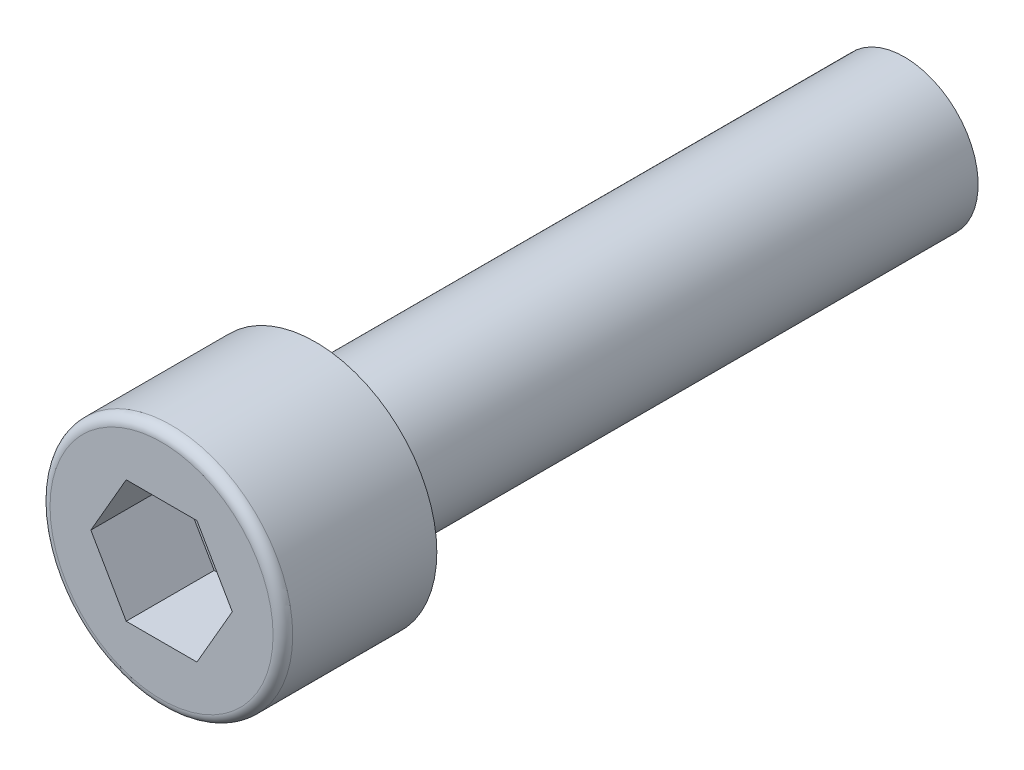
ISO-10303-21;
HEADER;
FILE_DESCRIPTION(('STEP AP214'),'2;1');
FILE_NAME('part.step','',(''),(''),'','','');
FILE_SCHEMA(('AUTOMOTIVE_DESIGN { 1 0 10303 214 1 1 1 1 }'));
ENDSEC;
DATA;
#1=APPLICATION_CONTEXT('core data for automotive mechanical design processes');
#2=APPLICATION_PROTOCOL_DEFINITION('international standard','automotive_design',2000,#1);
#3=PRODUCT_CONTEXT('',#1,'mechanical');
#4=PRODUCT('Part','Part','',(#3));
#5=PRODUCT_RELATED_PRODUCT_CATEGORY('part','',(#4));
#6=PRODUCT_DEFINITION_FORMATION('','',#4);
#7=PRODUCT_DEFINITION_CONTEXT('part definition',#1,'design');
#8=PRODUCT_DEFINITION('design','',#6,#7);
#9=PRODUCT_DEFINITION_SHAPE('','',#8);
#10=(LENGTH_UNIT() NAMED_UNIT(*) SI_UNIT(.MILLI.,.METRE.));
#11=(NAMED_UNIT(*) PLANE_ANGLE_UNIT() SI_UNIT($,.RADIAN.));
#12=(NAMED_UNIT(*) SI_UNIT($,.STERADIAN.) SOLID_ANGLE_UNIT());
#13=UNCERTAINTY_MEASURE_WITH_UNIT(LENGTH_MEASURE(1.E-05),#10,'distance_accuracy_value','');
#14=(GEOMETRIC_REPRESENTATION_CONTEXT(3) GLOBAL_UNCERTAINTY_ASSIGNED_CONTEXT((#13)) GLOBAL_UNIT_ASSIGNED_CONTEXT((#10,
#11,#12)) REPRESENTATION_CONTEXT('',''));
#15=CARTESIAN_POINT('',(0.,0.,0.));
#16=DIRECTION('',(0.,0.,1.));
#17=DIRECTION('',(1.,0.,0.));
#18=AXIS2_PLACEMENT_3D('',#15,#16,#17);
#19=CARTESIAN_POINT('',(0.,0.,2.13360000000001));
#20=DIRECTION('',(0.,0.,1.));
#21=DIRECTION('',(1.,0.,0.));
#22=AXIS2_PLACEMENT_3D('',#19,#20,#21);
#23=PLANE('',#22);
#24=DIRECTION('',(-0.5,-0.866025403784439,0.));
#25=VECTOR('',#24,1.);
#26=CARTESIAN_POINT('',(1.14384635331848,-1.98120000000001,2.13360000000001));
#27=LINE('',#26,#25);
#28=CARTESIAN_POINT('',(2.28769270663695,0.,2.13360000000001));
#29=VERTEX_POINT('',#28);
#30=CARTESIAN_POINT('',(1.14384635331848,-1.98120000000002,2.13360000000001));
#31=VERTEX_POINT('',#30);
#32=EDGE_CURVE('E73',#29,#31,#27,.T.);
#33=ORIENTED_EDGE('',*,*,#32,.F.);
#34=DIRECTION('',(0.500000000000001,-0.866025403784438,0.));
#35=VECTOR('',#34,1.);
#36=CARTESIAN_POINT('',(2.28769270663694,0.,2.13360000000001));
#37=LINE('',#36,#35);
#38=CARTESIAN_POINT('',(1.14384635331846,1.98119999999999,2.13360000000001));
#39=VERTEX_POINT('',#38);
#40=EDGE_CURVE('E123',#39,#29,#37,.T.);
#41=ORIENTED_EDGE('',*,*,#40,.F.);
#42=DIRECTION('',(1.,0.,0.));
#43=VECTOR('',#42,1.);
#44=CARTESIAN_POINT('',(1.14384635331847,1.98119999999999,2.13360000000001));
#45=LINE('',#44,#43);
#46=CARTESIAN_POINT('',(-1.1438463533185,1.98119999999998,2.13360000000001));
#47=VERTEX_POINT('',#46);
#48=EDGE_CURVE('E126',#47,#39,#45,.T.);
#49=ORIENTED_EDGE('',*,*,#48,.F.);
#50=DIRECTION('',(0.499999999999999,0.866025403784439,0.));
#51=VECTOR('',#50,1.);
#52=CARTESIAN_POINT('',(-1.14384635331851,1.98119999999997,2.13360000000001));
#53=LINE('',#52,#51);
#54=CARTESIAN_POINT('',(-2.28769270663698,0.,2.13360000000001));
#55=VERTEX_POINT('',#54);
#56=EDGE_CURVE('E131',#55,#47,#53,.T.);
#57=ORIENTED_EDGE('',*,*,#56,.F.);
#58=DIRECTION('',(-0.500000000000001,0.866025403784438,0.));
#59=VECTOR('',#58,1.);
#60=CARTESIAN_POINT('',(-2.28769270663698,0.,2.13360000000001));
#61=LINE('',#60,#59);
#62=CARTESIAN_POINT('',(-1.14384635331851,-1.98120000000002,2.13360000000001));
#63=VERTEX_POINT('',#62);
#64=EDGE_CURVE('E84',#63,#55,#61,.T.);
#65=ORIENTED_EDGE('',*,*,#64,.F.);
#66=DIRECTION('',(-1.,0.,0.));
#67=VECTOR('',#66,1.);
#68=CARTESIAN_POINT('',(-1.14384635331852,-1.98120000000002,2.13360000000001));
#69=LINE('',#68,#67);
#70=EDGE_CURVE('E68',#31,#63,#69,.T.);
#71=ORIENTED_EDGE('',*,*,#70,.F.);
#72=EDGE_LOOP('',(#33,#41,#49,#57,#65,#71));
#73=FACE_BOUND('',#72,.T.);
#74=ADVANCED_FACE('F17',(#73),#23,.T.);
#75=CARTESIAN_POINT('',(1.14384635331848,-1.98120000000001,4.97839999999999));
#76=DIRECTION('',(-0.866025403784439,0.5,0.));
#77=DIRECTION('',(-0.5,-0.866025403784439,0.));
#78=AXIS2_PLACEMENT_3D('',#75,#76,#77);
#79=PLANE('',#78);
#80=ORIENTED_EDGE('',*,*,#32,.T.);
#81=DIRECTION('',(0.,0.,1.));
#82=VECTOR('',#81,1.);
#83=CARTESIAN_POINT('',(1.14384635331848,-1.98120000000002,4.97839999999999));
#84=LINE('',#83,#82);
#85=CARTESIAN_POINT('',(1.14384635331848,-1.98120000000001,4.97839999999999));
#86=VERTEX_POINT('',#85);
#87=EDGE_CURVE('E75',#86,#31,#84,.F.);
#88=ORIENTED_EDGE('',*,*,#87,.F.);
#89=DIRECTION('',(-0.499999999999997,-0.866025403784441,0.));
#90=VECTOR('',#89,1.);
#91=CARTESIAN_POINT('',(2.28769270663694,0.,4.97839999999999));
#92=LINE('',#91,#90);
#93=CARTESIAN_POINT('',(2.28769270663695,0.,4.97839999999999));
#94=VERTEX_POINT('',#93);
#95=EDGE_CURVE('E120',#94,#86,#92,.T.);
#96=ORIENTED_EDGE('',*,*,#95,.F.);
#97=DIRECTION('',(0.,0.,1.));
#98=VECTOR('',#97,1.);
#99=CARTESIAN_POINT('',(2.28769270663694,0.,4.97839999999999));
#100=LINE('',#99,#98);
#101=EDGE_CURVE('E78',#29,#94,#100,.T.);
#102=ORIENTED_EDGE('',*,*,#101,.F.);
#103=EDGE_LOOP('',(#80,#88,#96,#102));
#104=FACE_BOUND('',#103,.T.);
#105=ADVANCED_FACE('F74',(#104),#79,.T.);
#106=CARTESIAN_POINT('',(-1.14384635331852,-1.98120000000002,4.97839999999999));
#107=DIRECTION('',(0.,1.,0.));
#108=DIRECTION('',(-1.,0.,0.));
#109=AXIS2_PLACEMENT_3D('',#106,#107,#108);
#110=PLANE('',#109);
#111=ORIENTED_EDGE('',*,*,#70,.T.);
#112=DIRECTION('',(0.,0.,1.));
#113=VECTOR('',#112,1.);
#114=CARTESIAN_POINT('',(-1.1438463533185,-1.98120000000001,4.97839999999999));
#115=LINE('',#114,#113);
#116=CARTESIAN_POINT('',(-1.14384635331852,-1.98120000000002,4.97839999999999));
#117=VERTEX_POINT('',#116);
#118=EDGE_CURVE('E86',#117,#63,#115,.F.);
#119=ORIENTED_EDGE('',*,*,#118,.F.);
#120=DIRECTION('',(1.,0.,0.));
#121=VECTOR('',#120,1.);
#122=CARTESIAN_POINT('',(0.,-1.98120000000001,4.97839999999999));
#123=LINE('',#122,#121);
#124=EDGE_CURVE('E90',#86,#117,#123,.F.);
#125=ORIENTED_EDGE('',*,*,#124,.F.);
#126=ORIENTED_EDGE('',*,*,#87,.T.);
#127=EDGE_LOOP('',(#111,#119,#125,#126));
#128=FACE_BOUND('',#127,.T.);
#129=ADVANCED_FACE('F88',(#128),#110,.T.);
#130=CARTESIAN_POINT('',(-2.28769270663698,0.,4.97839999999999));
#131=DIRECTION('',(0.866025403784438,0.500000000000001,0.));
#132=DIRECTION('',(-0.500000000000001,0.866025403784438,0.));
#133=AXIS2_PLACEMENT_3D('',#130,#131,#132);
#134=PLANE('',#133);
#135=ORIENTED_EDGE('',*,*,#64,.T.);
#136=DIRECTION('',(0.,0.,1.));
#137=VECTOR('',#136,1.);
#138=CARTESIAN_POINT('',(-2.287692706637,0.,4.97839999999999));
#139=LINE('',#138,#137);
#140=CARTESIAN_POINT('',(-2.28769270663698,0.,4.97839999999999));
#141=VERTEX_POINT('',#140);
#142=EDGE_CURVE('E133',#141,#55,#139,.F.);
#143=ORIENTED_EDGE('',*,*,#142,.F.);
#144=DIRECTION('',(-0.499999999999994,0.866025403784442,0.));
#145=VECTOR('',#144,1.);
#146=CARTESIAN_POINT('',(-1.14384635331852,-1.98120000000002,4.97839999999999));
#147=LINE('',#146,#145);
#148=EDGE_CURVE('E116',#117,#141,#147,.T.);
#149=ORIENTED_EDGE('',*,*,#148,.F.);
#150=ORIENTED_EDGE('',*,*,#118,.T.);
#151=EDGE_LOOP('',(#135,#143,#149,#150));
#152=FACE_BOUND('',#151,.T.);
#153=ADVANCED_FACE('F138',(#152),#134,.T.);
#154=CARTESIAN_POINT('',(-1.14384635331851,1.98119999999997,4.97839999999999));
#155=DIRECTION('',(0.866025403784439,-0.499999999999999,0.));
#156=DIRECTION('',(0.499999999999999,0.866025403784439,0.));
#157=AXIS2_PLACEMENT_3D('',#154,#155,#156);
#158=PLANE('',#157);
#159=ORIENTED_EDGE('',*,*,#56,.T.);
#160=DIRECTION('',(0.,0.,-1.));
#161=VECTOR('',#160,1.);
#162=CARTESIAN_POINT('',(-1.1438463533185,1.98119999999999,4.97839999999999));
#163=LINE('',#162,#161);
#164=CARTESIAN_POINT('',(-1.1438463533185,1.98119999999998,4.97839999999999));
#165=VERTEX_POINT('',#164);
#166=EDGE_CURVE('E128',#165,#47,#163,.T.);
#167=ORIENTED_EDGE('',*,*,#166,.F.);
#168=DIRECTION('',(0.499999999999998,0.86602540378444,0.));
#169=VECTOR('',#168,1.);
#170=CARTESIAN_POINT('',(-2.28769270663698,0.,4.97839999999999));
#171=LINE('',#170,#169);
#172=EDGE_CURVE('E113',#141,#165,#171,.T.);
#173=ORIENTED_EDGE('',*,*,#172,.F.);
#174=ORIENTED_EDGE('',*,*,#142,.T.);
#175=EDGE_LOOP('',(#159,#167,#173,#174));
#176=FACE_BOUND('',#175,.T.);
#177=ADVANCED_FACE('F148',(#176),#158,.T.);
#178=CARTESIAN_POINT('',(1.14384635331847,1.98119999999999,4.97839999999999));
#179=DIRECTION('',(0.,-1.,0.));
#180=DIRECTION('',(0.,0.,-1.));
#181=AXIS2_PLACEMENT_3D('',#178,#179,#180);
#182=PLANE('',#181);
#183=ORIENTED_EDGE('',*,*,#48,.T.);
#184=DIRECTION('',(0.,0.,1.));
#185=VECTOR('',#184,1.);
#186=CARTESIAN_POINT('',(1.14384635331845,1.98119999999998,4.97839999999999));
#187=LINE('',#186,#185);
#188=CARTESIAN_POINT('',(1.14384635331847,1.98119999999998,4.97839999999999));
#189=VERTEX_POINT('',#188);
#190=EDGE_CURVE('E36',#189,#39,#187,.F.);
#191=ORIENTED_EDGE('',*,*,#190,.F.);
#192=DIRECTION('',(1.,0.,0.));
#193=VECTOR('',#192,1.);
#194=CARTESIAN_POINT('',(0.,1.98119999999997,4.97839999999999));
#195=LINE('',#194,#193);
#196=EDGE_CURVE('E110',#165,#189,#195,.T.);
#197=ORIENTED_EDGE('',*,*,#196,.F.);
#198=ORIENTED_EDGE('',*,*,#166,.T.);
#199=EDGE_LOOP('',(#183,#191,#197,#198));
#200=FACE_BOUND('',#199,.T.);
#201=ADVANCED_FACE('F146',(#200),#182,.T.);
#202=CARTESIAN_POINT('',(2.28769270663694,0.,4.97839999999999));
#203=DIRECTION('',(-0.866025403784438,-0.500000000000001,0.));
#204=DIRECTION('',(0.500000000000001,-0.866025403784438,0.));
#205=AXIS2_PLACEMENT_3D('',#202,#203,#204);
#206=PLANE('',#205);
#207=ORIENTED_EDGE('',*,*,#40,.T.);
#208=ORIENTED_EDGE('',*,*,#101,.T.);
#209=DIRECTION('',(0.499999999999992,-0.866025403784443,0.));
#210=VECTOR('',#209,1.);
#211=CARTESIAN_POINT('',(1.14384635331847,1.98119999999999,4.97839999999999));
#212=LINE('',#211,#210);
#213=EDGE_CURVE('E106',#189,#94,#212,.T.);
#214=ORIENTED_EDGE('',*,*,#213,.F.);
#215=ORIENTED_EDGE('',*,*,#190,.T.);
#216=EDGE_LOOP('',(#207,#208,#214,#215));
#217=FACE_BOUND('',#216,.T.);
#218=ADVANCED_FACE('F144',(#217),#206,.T.);
#219=CARTESIAN_POINT('',(0.,0.,4.97839999999999));
#220=DIRECTION('',(0.,0.,1.));
#221=DIRECTION('',(1.,0.,0.));
#222=AXIS2_PLACEMENT_3D('',#219,#220,#221);
#223=PLANE('',#222);
#224=ORIENTED_EDGE('',*,*,#196,.T.);
#225=ORIENTED_EDGE('',*,*,#213,.T.);
#226=ORIENTED_EDGE('',*,*,#95,.T.);
#227=ORIENTED_EDGE('',*,*,#124,.T.);
#228=ORIENTED_EDGE('',*,*,#148,.T.);
#229=ORIENTED_EDGE('',*,*,#172,.T.);
#230=EDGE_LOOP('',(#224,#225,#226,#227,#228,#229));
#231=FACE_BOUND('',#230,.T.);
#232=CARTESIAN_POINT('',(0.,0.,4.97840000000002));
#233=DIRECTION('',(0.,0.,-1.));
#234=DIRECTION('',(-1.,0.,0.));
#235=AXIS2_PLACEMENT_3D('',#232,#233,#234);
#236=CIRCLE('',#235,3.60680000000002);
#237=CARTESIAN_POINT('',(-3.60680000000002,0.,4.97840000000002));
#238=VERTEX_POINT('',#237);
#239=EDGE_CURVE('E21',#238,#238,#236,.T.);
#240=ORIENTED_EDGE('',*,*,#239,.F.);
#241=EDGE_LOOP('',(#240));
#242=FACE_BOUND('',#241,.T.);
#243=ADVANCED_FACE('F141',(#231,#242),#223,.T.);
#244=CARTESIAN_POINT('',(0.,0.,4.66090000000002));
#245=DIRECTION('',(0.,0.,-1.));
#246=DIRECTION('',(-1.,0.,0.));
#247=AXIS2_PLACEMENT_3D('',#244,#245,#246);
#248=TOROIDAL_SURFACE('',#247,3.60680000000003,0.317500000000001);
#249=ORIENTED_EDGE('',*,*,#239,.T.);
#250=EDGE_LOOP('',(#249));
#251=FACE_BOUND('',#250,.T.);
#252=CARTESIAN_POINT('',(0.,0.,4.66090000000002));
#253=DIRECTION('',(0.,0.,1.));
#254=DIRECTION('',(1.,0.,0.));
#255=AXIS2_PLACEMENT_3D('',#252,#253,#254);
#256=CIRCLE('',#255,3.92430000000001);
#257=CARTESIAN_POINT('',(3.92430000000001,0.,4.66090000000002));
#258=VERTEX_POINT('',#257);
#259=EDGE_CURVE('E98',#258,#258,#256,.F.);
#260=ORIENTED_EDGE('',*,*,#259,.F.);
#261=EDGE_LOOP('',(#260));
#262=FACE_BOUND('',#261,.T.);
#263=ADVANCED_FACE('F19',(#251,#262),#248,.T.);
#264=CARTESIAN_POINT('',(0.,0.,0.));
#265=DIRECTION('',(0.,0.,1.));
#266=DIRECTION('',(1.,0.,0.));
#267=AXIS2_PLACEMENT_3D('',#264,#265,#266);
#268=CYLINDRICAL_SURFACE('',#267,3.92430000000001);
#269=ORIENTED_EDGE('',*,*,#259,.T.);
#270=EDGE_LOOP('',(#269));
#271=FACE_BOUND('',#270,.T.);
#272=CARTESIAN_POINT('',(0.,0.,0.));
#273=DIRECTION('',(0.,0.,1.));
#274=DIRECTION('',(1.,0.,0.));
#275=AXIS2_PLACEMENT_3D('',#272,#273,#274);
#276=CIRCLE('',#275,3.92430000000001);
#277=CARTESIAN_POINT('',(3.92430000000001,0.,0.));
#278=VERTEX_POINT('',#277);
#279=EDGE_CURVE('E96',#278,#278,#276,.F.);
#280=ORIENTED_EDGE('',*,*,#279,.F.);
#281=EDGE_LOOP('',(#280));
#282=FACE_BOUND('',#281,.T.);
#283=ADVANCED_FACE('F173',(#271,#282),#268,.T.);
#284=CARTESIAN_POINT('',(0.,0.,0.));
#285=DIRECTION('',(0.,0.,-1.));
#286=DIRECTION('',(-1.,0.,0.));
#287=AXIS2_PLACEMENT_3D('',#284,#285,#286);
#288=PLANE('',#287);
#289=CARTESIAN_POINT('',(0.,0.,0.));
#290=DIRECTION('',(0.,0.,-1.));
#291=DIRECTION('',(-1.,0.,0.));
#292=AXIS2_PLACEMENT_3D('',#289,#290,#291);
#293=CIRCLE('',#292,2.38125);
#294=CARTESIAN_POINT('',(-2.38125,0.,0.));
#295=VERTEX_POINT('',#294);
#296=EDGE_CURVE('E27',#295,#295,#293,.T.);
#297=ORIENTED_EDGE('',*,*,#296,.F.);
#298=EDGE_LOOP('',(#297));
#299=FACE_BOUND('',#298,.T.);
#300=ORIENTED_EDGE('',*,*,#279,.T.);
#301=EDGE_LOOP('',(#300));
#302=FACE_BOUND('',#301,.T.);
#303=ADVANCED_FACE('F166',(#299,#302),#288,.T.);
#304=CARTESIAN_POINT('',(0.,0.,-19.05));
#305=DIRECTION('',(0.,0.,-1.));
#306=DIRECTION('',(-1.,0.,0.));
#307=AXIS2_PLACEMENT_3D('',#304,#305,#306);
#308=PLANE('',#307);
#309=CARTESIAN_POINT('',(0.,0.,-19.05));
#310=DIRECTION('',(0.,0.,-1.));
#311=DIRECTION('',(-1.,0.,0.));
#312=AXIS2_PLACEMENT_3D('',#309,#310,#311);
#313=CIRCLE('',#312,2.38125);
#314=CARTESIAN_POINT('',(-2.38125,0.,-19.05));
#315=VERTEX_POINT('',#314);
#316=EDGE_CURVE('E11',#315,#315,#313,.F.);
#317=ORIENTED_EDGE('',*,*,#316,.F.);
#318=EDGE_LOOP('',(#317));
#319=FACE_BOUND('',#318,.T.);
#320=ADVANCED_FACE('F160',(#319),#308,.T.);
#321=CARTESIAN_POINT('',(0.,0.,0.));
#322=DIRECTION('',(0.,0.,-1.));
#323=DIRECTION('',(-1.,0.,0.));
#324=AXIS2_PLACEMENT_3D('',#321,#322,#323);
#325=CYLINDRICAL_SURFACE('',#324,2.38125);
#326=ORIENTED_EDGE('',*,*,#316,.T.);
#327=EDGE_LOOP('',(#326));
#328=FACE_BOUND('',#327,.T.);
#329=ORIENTED_EDGE('',*,*,#296,.T.);
#330=EDGE_LOOP('',(#329));
#331=FACE_BOUND('',#330,.T.);
#332=ADVANCED_FACE('F158',(#328,#331),#325,.T.);
#333=CLOSED_SHELL('',(#74,#105,#129,#153,#177,#201,#218,#243,#263,#283,#303,#320,#332));
#334=MANIFOLD_SOLID_BREP('B1',#333);
#335=ADVANCED_BREP_SHAPE_REPRESENTATION('',(#18,#334),#14);
#336=SHAPE_DEFINITION_REPRESENTATION(#9,#335);
ENDSEC;
END-ISO-10303-21;
